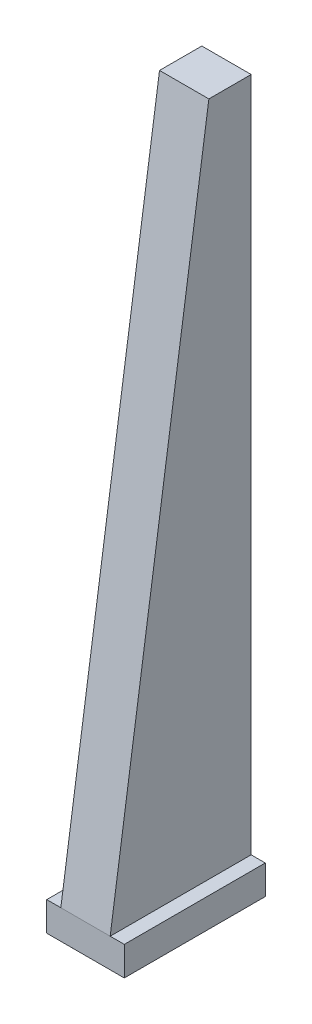
ISO-10303-21;
HEADER;
FILE_DESCRIPTION(('STEP AP214'),'2;1');
FILE_NAME('part.step','',(''),(''),'','','');
FILE_SCHEMA(('AUTOMOTIVE_DESIGN { 1 0 10303 214 1 1 1 1 }'));
ENDSEC;
DATA;
#1=APPLICATION_CONTEXT('core data for automotive mechanical design processes');
#2=APPLICATION_PROTOCOL_DEFINITION('international standard','automotive_design',2000,#1);
#3=PRODUCT_CONTEXT('',#1,'mechanical');
#4=PRODUCT('Part','Part','',(#3));
#5=PRODUCT_RELATED_PRODUCT_CATEGORY('part','',(#4));
#6=PRODUCT_DEFINITION_FORMATION('','',#4);
#7=PRODUCT_DEFINITION_CONTEXT('part definition',#1,'design');
#8=PRODUCT_DEFINITION('design','',#6,#7);
#9=PRODUCT_DEFINITION_SHAPE('','',#8);
#10=(LENGTH_UNIT() NAMED_UNIT(*) SI_UNIT(.MILLI.,.METRE.));
#11=(NAMED_UNIT(*) PLANE_ANGLE_UNIT() SI_UNIT($,.RADIAN.));
#12=(NAMED_UNIT(*) SI_UNIT($,.STERADIAN.) SOLID_ANGLE_UNIT());
#13=UNCERTAINTY_MEASURE_WITH_UNIT(LENGTH_MEASURE(1.E-05),#10,'distance_accuracy_value','');
#14=(GEOMETRIC_REPRESENTATION_CONTEXT(3) GLOBAL_UNCERTAINTY_ASSIGNED_CONTEXT((#13)) GLOBAL_UNIT_ASSIGNED_CONTEXT((#10,
#11,#12)) REPRESENTATION_CONTEXT('',''));
#15=CARTESIAN_POINT('',(0.,0.,0.));
#16=DIRECTION('',(0.,0.,1.));
#17=DIRECTION('',(1.,0.,0.));
#18=AXIS2_PLACEMENT_3D('',#15,#16,#17);
#19=CARTESIAN_POINT('',(-88.9000000000003,2540.,254.));
#20=DIRECTION('',(1.,0.,0.));
#21=DIRECTION('',(0.,1.,0.));
#22=AXIS2_PLACEMENT_3D('',#19,#20,#21);
#23=PLANE('',#22);
#24=DIRECTION('',(0.,-0.989504525132579,0.144501884908641));
#25=VECTOR('',#24,1.);
#26=CARTESIAN_POINT('',(-88.9000000000003,2489.15443834101,-94.1747893896914));
#27=LINE('',#26,#25);
#28=CARTESIAN_POINT('',(-88.9000000000003,2540.,-101.6));
#29=VERTEX_POINT('',#28);
#30=CARTESIAN_POINT('',(-88.9,104.96042,254.));
#31=VERTEX_POINT('',#30);
#32=EDGE_CURVE('E94',#29,#31,#27,.T.);
#33=ORIENTED_EDGE('',*,*,#32,.F.);
#34=DIRECTION('',(0.,0.,-1.));
#35=VECTOR('',#34,1.);
#36=CARTESIAN_POINT('',(-88.9000000000003,2540.,254.));
#37=LINE('',#36,#35);
#38=CARTESIAN_POINT('',(-88.9000000000003,2540.,-254.));
#39=VERTEX_POINT('',#38);
#40=EDGE_CURVE('E88',#29,#39,#37,.T.);
#41=ORIENTED_EDGE('',*,*,#40,.T.);
#42=DIRECTION('',(0.,-1.,0.));
#43=VECTOR('',#42,1.);
#44=CARTESIAN_POINT('',(-88.9000000000003,2540.,-254.));
#45=LINE('',#44,#43);
#46=CARTESIAN_POINT('',(-88.9,104.96042,-254.));
#47=VERTEX_POINT('',#46);
#48=EDGE_CURVE('E132',#39,#47,#45,.T.);
#49=ORIENTED_EDGE('',*,*,#48,.T.);
#50=DIRECTION('',(0.,0.,-1.));
#51=VECTOR('',#50,1.);
#52=CARTESIAN_POINT('',(-88.9,104.96042,254.));
#53=LINE('',#52,#51);
#54=EDGE_CURVE('E42',#31,#47,#53,.T.);
#55=ORIENTED_EDGE('',*,*,#54,.F.);
#56=EDGE_LOOP('',(#33,#41,#49,#55));
#57=FACE_BOUND('',#56,.T.);
#58=ADVANCED_FACE('F34',(#57),#23,.F.);
#59=CARTESIAN_POINT('',(88.9000000000003,2540.,254.));
#60=DIRECTION('',(-1.,0.,0.));
#61=DIRECTION('',(0.,-1.,0.));
#62=AXIS2_PLACEMENT_3D('',#59,#60,#61);
#63=PLANE('',#62);
#64=DIRECTION('',(0.,0.989504525132579,-0.144501884908641));
#65=VECTOR('',#64,1.);
#66=CARTESIAN_POINT('',(88.9000000000003,2489.15443834101,-94.1747893896911));
#67=LINE('',#66,#65);
#68=CARTESIAN_POINT('',(88.9,104.96042,254.));
#69=VERTEX_POINT('',#68);
#70=CARTESIAN_POINT('',(88.9000000000003,2540.,-101.6));
#71=VERTEX_POINT('',#70);
#72=EDGE_CURVE('E177',#69,#71,#67,.T.);
#73=ORIENTED_EDGE('',*,*,#72,.F.);
#74=DIRECTION('',(0.,0.,-1.));
#75=VECTOR('',#74,1.);
#76=CARTESIAN_POINT('',(88.9,104.96042,254.));
#77=LINE('',#76,#75);
#78=CARTESIAN_POINT('',(88.9,104.96042,-254.));
#79=VERTEX_POINT('',#78);
#80=EDGE_CURVE('E149',#69,#79,#77,.T.);
#81=ORIENTED_EDGE('',*,*,#80,.T.);
#82=DIRECTION('',(0.,1.,0.));
#83=VECTOR('',#82,1.);
#84=CARTESIAN_POINT('',(88.9000000000003,2540.,-254.));
#85=LINE('',#84,#83);
#86=CARTESIAN_POINT('',(88.9000000000003,2540.,-254.));
#87=VERTEX_POINT('',#86);
#88=EDGE_CURVE('E143',#79,#87,#85,.T.);
#89=ORIENTED_EDGE('',*,*,#88,.T.);
#90=DIRECTION('',(0.,0.,-1.));
#91=VECTOR('',#90,1.);
#92=CARTESIAN_POINT('',(88.9000000000003,2540.,254.));
#93=LINE('',#92,#91);
#94=EDGE_CURVE('E80',#71,#87,#93,.T.);
#95=ORIENTED_EDGE('',*,*,#94,.F.);
#96=EDGE_LOOP('',(#73,#81,#89,#95));
#97=FACE_BOUND('',#96,.T.);
#98=ADVANCED_FACE('F185',(#97),#63,.F.);
#99=CARTESIAN_POINT('',(88.9000000000003,2540.,254.));
#100=DIRECTION('',(0.,-1.,0.));
#101=DIRECTION('',(1.,0.,0.));
#102=AXIS2_PLACEMENT_3D('',#99,#100,#101);
#103=PLANE('',#102);
#104=DIRECTION('',(1.,0.,0.));
#105=VECTOR('',#104,1.);
#106=CARTESIAN_POINT('',(-139.7,2540.,-101.6));
#107=LINE('',#106,#105);
#108=EDGE_CURVE('E179',#29,#71,#107,.T.);
#109=ORIENTED_EDGE('',*,*,#108,.T.);
#110=ORIENTED_EDGE('',*,*,#94,.T.);
#111=DIRECTION('',(-1.,0.,0.));
#112=VECTOR('',#111,1.);
#113=CARTESIAN_POINT('',(88.9000000000003,2540.,-254.));
#114=LINE('',#113,#112);
#115=EDGE_CURVE('E145',#87,#39,#114,.T.);
#116=ORIENTED_EDGE('',*,*,#115,.T.);
#117=ORIENTED_EDGE('',*,*,#40,.F.);
#118=EDGE_LOOP('',(#109,#110,#116,#117));
#119=FACE_BOUND('',#118,.T.);
#120=ADVANCED_FACE('F183',(#119),#103,.F.);
#121=CARTESIAN_POINT('',(0.,0.,254.));
#122=DIRECTION('',(0.,0.,-1.));
#123=DIRECTION('',(-1.,0.,0.));
#124=AXIS2_PLACEMENT_3D('',#121,#122,#123);
#125=PLANE('',#124);
#126=DIRECTION('',(1.,0.,0.));
#127=VECTOR('',#126,1.);
#128=CARTESIAN_POINT('',(0.,104.960420000001,254.));
#129=LINE('',#128,#127);
#130=EDGE_CURVE('E12',#31,#69,#129,.T.);
#131=ORIENTED_EDGE('',*,*,#130,.F.);
#132=DIRECTION('',(-1.,0.,0.));
#133=VECTOR('',#132,1.);
#134=CARTESIAN_POINT('',(-88.9,104.96042,254.));
#135=LINE('',#134,#133);
#136=CARTESIAN_POINT('',(-139.7,104.96042,254.));
#137=VERTEX_POINT('',#136);
#138=EDGE_CURVE('E109',#31,#137,#135,.T.);
#139=ORIENTED_EDGE('',*,*,#138,.T.);
#140=DIRECTION('',(0.,-1.,0.));
#141=VECTOR('',#140,1.);
#142=CARTESIAN_POINT('',(-139.7,104.96042,254.));
#143=LINE('',#142,#141);
#144=CARTESIAN_POINT('',(-139.7,0.,254.));
#145=VERTEX_POINT('',#144);
#146=EDGE_CURVE('E102',#137,#145,#143,.T.);
#147=ORIENTED_EDGE('',*,*,#146,.T.);
#148=DIRECTION('',(1.,0.,0.));
#149=VECTOR('',#148,1.);
#150=CARTESIAN_POINT('',(-139.7,0.,254.));
#151=LINE('',#150,#149);
#152=CARTESIAN_POINT('',(139.7,0.,254.));
#153=VERTEX_POINT('',#152);
#154=EDGE_CURVE('E106',#145,#153,#151,.T.);
#155=ORIENTED_EDGE('',*,*,#154,.T.);
#156=DIRECTION('',(0.,1.,0.));
#157=VECTOR('',#156,1.);
#158=CARTESIAN_POINT('',(139.7,104.96042,254.));
#159=LINE('',#158,#157);
#160=CARTESIAN_POINT('',(139.7,104.96042,254.));
#161=VERTEX_POINT('',#160);
#162=EDGE_CURVE('E50',#153,#161,#159,.T.);
#163=ORIENTED_EDGE('',*,*,#162,.T.);
#164=DIRECTION('',(-1.,0.,0.));
#165=VECTOR('',#164,1.);
#166=CARTESIAN_POINT('',(88.9,104.96042,254.));
#167=LINE('',#166,#165);
#168=EDGE_CURVE('E127',#161,#69,#167,.T.);
#169=ORIENTED_EDGE('',*,*,#168,.T.);
#170=EDGE_LOOP('',(#131,#139,#147,#155,#163,#169));
#171=FACE_BOUND('',#170,.T.);
#172=ADVANCED_FACE('F104',(#171),#125,.F.);
#173=CARTESIAN_POINT('',(-88.9,104.96042,254.));
#174=DIRECTION('',(0.,-1.,0.));
#175=DIRECTION('',(1.,0.,0.));
#176=AXIS2_PLACEMENT_3D('',#173,#174,#175);
#177=PLANE('',#176);
#178=DIRECTION('',(-1.,0.,0.));
#179=VECTOR('',#178,1.);
#180=CARTESIAN_POINT('',(-88.9,104.96042,-254.));
#181=LINE('',#180,#179);
#182=CARTESIAN_POINT('',(-139.7,104.96042,-254.));
#183=VERTEX_POINT('',#182);
#184=EDGE_CURVE('E134',#47,#183,#181,.T.);
#185=ORIENTED_EDGE('',*,*,#184,.T.);
#186=DIRECTION('',(0.,0.,-1.));
#187=VECTOR('',#186,1.);
#188=CARTESIAN_POINT('',(-139.7,104.96042,254.));
#189=LINE('',#188,#187);
#190=EDGE_CURVE('E121',#137,#183,#189,.T.);
#191=ORIENTED_EDGE('',*,*,#190,.F.);
#192=ORIENTED_EDGE('',*,*,#138,.F.);
#193=ORIENTED_EDGE('',*,*,#54,.T.);
#194=EDGE_LOOP('',(#185,#191,#192,#193));
#195=FACE_BOUND('',#194,.T.);
#196=ADVANCED_FACE('F159',(#195),#177,.F.);
#197=CARTESIAN_POINT('',(-139.7,104.96042,254.));
#198=DIRECTION('',(1.,0.,0.));
#199=DIRECTION('',(0.,1.,0.));
#200=AXIS2_PLACEMENT_3D('',#197,#198,#199);
#201=PLANE('',#200);
#202=DIRECTION('',(0.,-1.,0.));
#203=VECTOR('',#202,1.);
#204=CARTESIAN_POINT('',(-139.7,104.96042,-254.));
#205=LINE('',#204,#203);
#206=CARTESIAN_POINT('',(-139.7,0.,-254.));
#207=VERTEX_POINT('',#206);
#208=EDGE_CURVE('E118',#183,#207,#205,.T.);
#209=ORIENTED_EDGE('',*,*,#208,.T.);
#210=DIRECTION('',(0.,0.,-1.));
#211=VECTOR('',#210,1.);
#212=CARTESIAN_POINT('',(-139.7,0.,254.));
#213=LINE('',#212,#211);
#214=EDGE_CURVE('E115',#145,#207,#213,.T.);
#215=ORIENTED_EDGE('',*,*,#214,.F.);
#216=ORIENTED_EDGE('',*,*,#146,.F.);
#217=ORIENTED_EDGE('',*,*,#190,.T.);
#218=EDGE_LOOP('',(#209,#215,#216,#217));
#219=FACE_BOUND('',#218,.T.);
#220=ADVANCED_FACE('F116',(#219),#201,.F.);
#221=CARTESIAN_POINT('',(-139.7,0.,254.));
#222=DIRECTION('',(0.,1.,0.));
#223=DIRECTION('',(0.,0.,1.));
#224=AXIS2_PLACEMENT_3D('',#221,#222,#223);
#225=PLANE('',#224);
#226=DIRECTION('',(1.,0.,0.));
#227=VECTOR('',#226,1.);
#228=CARTESIAN_POINT('',(-139.7,0.,-254.));
#229=LINE('',#228,#227);
#230=CARTESIAN_POINT('',(139.7,0.,-254.));
#231=VERTEX_POINT('',#230);
#232=EDGE_CURVE('E137',#207,#231,#229,.T.);
#233=ORIENTED_EDGE('',*,*,#232,.T.);
#234=DIRECTION('',(0.,0.,-1.));
#235=VECTOR('',#234,1.);
#236=CARTESIAN_POINT('',(139.7,0.,254.));
#237=LINE('',#236,#235);
#238=EDGE_CURVE('E122',#153,#231,#237,.T.);
#239=ORIENTED_EDGE('',*,*,#238,.F.);
#240=ORIENTED_EDGE('',*,*,#154,.F.);
#241=ORIENTED_EDGE('',*,*,#214,.T.);
#242=EDGE_LOOP('',(#233,#239,#240,#241));
#243=FACE_BOUND('',#242,.T.);
#244=ADVANCED_FACE('F124',(#243),#225,.F.);
#245=CARTESIAN_POINT('',(139.7,104.96042,254.));
#246=DIRECTION('',(-1.,0.,0.));
#247=DIRECTION('',(0.,-1.,0.));
#248=AXIS2_PLACEMENT_3D('',#245,#246,#247);
#249=PLANE('',#248);
#250=DIRECTION('',(0.,1.,0.));
#251=VECTOR('',#250,1.);
#252=CARTESIAN_POINT('',(139.7,104.96042,-254.));
#253=LINE('',#252,#251);
#254=CARTESIAN_POINT('',(139.7,104.96042,-254.));
#255=VERTEX_POINT('',#254);
#256=EDGE_CURVE('E139',#231,#255,#253,.T.);
#257=ORIENTED_EDGE('',*,*,#256,.T.);
#258=DIRECTION('',(0.,0.,-1.));
#259=VECTOR('',#258,1.);
#260=CARTESIAN_POINT('',(139.7,104.96042,254.));
#261=LINE('',#260,#259);
#262=EDGE_CURVE('E152',#161,#255,#261,.T.);
#263=ORIENTED_EDGE('',*,*,#262,.F.);
#264=ORIENTED_EDGE('',*,*,#162,.F.);
#265=ORIENTED_EDGE('',*,*,#238,.T.);
#266=EDGE_LOOP('',(#257,#263,#264,#265));
#267=FACE_BOUND('',#266,.T.);
#268=ADVANCED_FACE('F168',(#267),#249,.F.);
#269=CARTESIAN_POINT('',(88.9,104.96042,254.));
#270=DIRECTION('',(0.,-1.,0.));
#271=DIRECTION('',(1.,0.,0.));
#272=AXIS2_PLACEMENT_3D('',#269,#270,#271);
#273=PLANE('',#272);
#274=DIRECTION('',(-1.,0.,0.));
#275=VECTOR('',#274,1.);
#276=CARTESIAN_POINT('',(88.9,104.96042,-254.));
#277=LINE('',#276,#275);
#278=EDGE_CURVE('E141',#255,#79,#277,.T.);
#279=ORIENTED_EDGE('',*,*,#278,.T.);
#280=ORIENTED_EDGE('',*,*,#80,.F.);
#281=ORIENTED_EDGE('',*,*,#168,.F.);
#282=ORIENTED_EDGE('',*,*,#262,.T.);
#283=EDGE_LOOP('',(#279,#280,#281,#282));
#284=FACE_BOUND('',#283,.T.);
#285=ADVANCED_FACE('F172',(#284),#273,.F.);
#286=CARTESIAN_POINT('',(0.,0.,-254.));
#287=DIRECTION('',(0.,0.,-1.));
#288=DIRECTION('',(-1.,0.,0.));
#289=AXIS2_PLACEMENT_3D('',#286,#287,#288);
#290=PLANE('',#289);
#291=ORIENTED_EDGE('',*,*,#48,.F.);
#292=ORIENTED_EDGE('',*,*,#115,.F.);
#293=ORIENTED_EDGE('',*,*,#88,.F.);
#294=ORIENTED_EDGE('',*,*,#278,.F.);
#295=ORIENTED_EDGE('',*,*,#256,.F.);
#296=ORIENTED_EDGE('',*,*,#232,.F.);
#297=ORIENTED_EDGE('',*,*,#208,.F.);
#298=ORIENTED_EDGE('',*,*,#184,.F.);
#299=EDGE_LOOP('',(#291,#292,#293,#294,#295,#296,#297,#298));
#300=FACE_BOUND('',#299,.T.);
#301=ADVANCED_FACE('F163',(#300),#290,.T.);
#302=CARTESIAN_POINT('',(-139.7,38.5099153139208,263.704072024312));
#303=DIRECTION('',(0.,0.144501884908641,0.989504525132579));
#304=DIRECTION('',(0.,-0.989504525132579,0.144501884908641));
#305=AXIS2_PLACEMENT_3D('',#302,#303,#304);
#306=PLANE('',#305);
#307=ORIENTED_EDGE('',*,*,#32,.T.);
#308=ORIENTED_EDGE('',*,*,#130,.T.);
#309=ORIENTED_EDGE('',*,*,#72,.T.);
#310=ORIENTED_EDGE('',*,*,#108,.F.);
#311=EDGE_LOOP('',(#307,#308,#309,#310));
#312=FACE_BOUND('',#311,.T.);
#313=ADVANCED_FACE('F180',(#312),#306,.T.);
#314=CLOSED_SHELL('',(#58,#98,#120,#172,#196,#220,#244,#268,#285,#301,#313));
#315=MANIFOLD_SOLID_BREP('B2',#314);
#316=ADVANCED_BREP_SHAPE_REPRESENTATION('',(#18,#315),#14);
#317=SHAPE_DEFINITION_REPRESENTATION(#9,#316);
ENDSEC;
END-ISO-10303-21;
